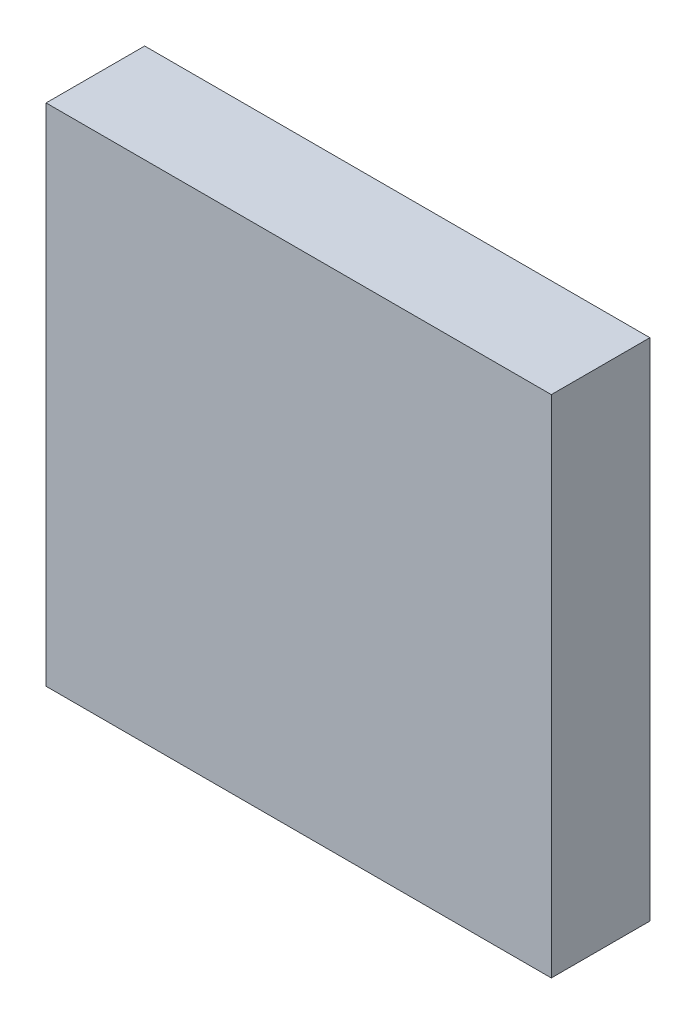
ISO-10303-21;
HEADER;
FILE_DESCRIPTION(('STEP AP214'),'2;1');
FILE_NAME('part.step','',(''),(''),'','','');
FILE_SCHEMA(('AUTOMOTIVE_DESIGN { 1 0 10303 214 1 1 1 1 }'));
ENDSEC;
DATA;
#1=APPLICATION_CONTEXT('core data for automotive mechanical design processes');
#2=APPLICATION_PROTOCOL_DEFINITION('international standard','automotive_design',2000,#1);
#3=PRODUCT_CONTEXT('',#1,'mechanical');
#4=PRODUCT('Part','Part','',(#3));
#5=PRODUCT_RELATED_PRODUCT_CATEGORY('part','',(#4));
#6=PRODUCT_DEFINITION_FORMATION('','',#4);
#7=PRODUCT_DEFINITION_CONTEXT('part definition',#1,'design');
#8=PRODUCT_DEFINITION('design','',#6,#7);
#9=PRODUCT_DEFINITION_SHAPE('','',#8);
#10=(LENGTH_UNIT() NAMED_UNIT(*) SI_UNIT(.MILLI.,.METRE.));
#11=(NAMED_UNIT(*) PLANE_ANGLE_UNIT() SI_UNIT($,.RADIAN.));
#12=(NAMED_UNIT(*) SI_UNIT($,.STERADIAN.) SOLID_ANGLE_UNIT());
#13=UNCERTAINTY_MEASURE_WITH_UNIT(LENGTH_MEASURE(1.E-05),#10,'distance_accuracy_value','');
#14=(GEOMETRIC_REPRESENTATION_CONTEXT(3) GLOBAL_UNCERTAINTY_ASSIGNED_CONTEXT((#13)) GLOBAL_UNIT_ASSIGNED_CONTEXT((#10,
#11,#12)) REPRESENTATION_CONTEXT('',''));
#15=CARTESIAN_POINT('',(0.,0.,0.));
#16=DIRECTION('',(0.,0.,1.));
#17=DIRECTION('',(1.,0.,0.));
#18=AXIS2_PLACEMENT_3D('',#15,#16,#17);
#19=CARTESIAN_POINT('',(2.04999844,-2.04999844,0.80000094));
#20=DIRECTION('',(0.,0.,-1.));
#21=DIRECTION('',(-1.,0.,0.));
#22=AXIS2_PLACEMENT_3D('',#19,#20,#21);
#23=PLANE('',#22);
#24=DIRECTION('',(0.999999999999808,6.19512282027681E-07,0.));
#25=VECTOR('',#24,1.);
#26=CARTESIAN_POINT('',(2.05000098,2.05000352,0.80000094));
#27=LINE('',#26,#25);
#28=CARTESIAN_POINT('',(2.05000098,2.05000225,0.80000094));
#29=VERTEX_POINT('',#28);
#30=CARTESIAN_POINT('',(-2.04999971,2.05000098,0.80000094));
#31=VERTEX_POINT('',#30);
#32=EDGE_CURVE('E55',#29,#31,#27,.F.);
#33=ORIENTED_EDGE('',*,*,#32,.T.);
#34=DIRECTION('',(6.19511899965481E-07,0.999999999999808,0.));
#35=VECTOR('',#34,1.);
#36=CARTESIAN_POINT('',(-2.04999844,2.05000098,0.80000094));
#37=LINE('',#36,#35);
#38=CARTESIAN_POINT('',(-2.05000098,-2.04999971,0.80000094));
#39=VERTEX_POINT('',#38);
#40=EDGE_CURVE('E57',#31,#39,#37,.F.);
#41=ORIENTED_EDGE('',*,*,#40,.T.);
#42=DIRECTION('',(-0.999999999999808,-6.19512282027681E-07,0.));
#43=VECTOR('',#42,1.);
#44=CARTESIAN_POINT('',(-2.05000098,-2.05000098,0.80000094));
#45=LINE('',#44,#43);
#46=CARTESIAN_POINT('',(2.049999075,-2.04999844,0.80000094));
#47=VERTEX_POINT('',#46);
#48=EDGE_CURVE('E20',#39,#47,#45,.F.);
#49=ORIENTED_EDGE('',*,*,#48,.T.);
#50=DIRECTION('',(-6.19511898232481E-07,-0.999999999999808,0.));
#51=VECTOR('',#50,1.);
#52=CARTESIAN_POINT('',(2.04999844,-2.04999844,0.80000094));
#53=LINE('',#52,#51);
#54=EDGE_CURVE('E80',#47,#29,#53,.F.);
#55=ORIENTED_EDGE('',*,*,#54,.T.);
#56=EDGE_LOOP('',(#33,#41,#49,#55));
#57=FACE_BOUND('',#56,.T.);
#58=ADVANCED_FACE('F17',(#57),#23,.F.);
#59=CARTESIAN_POINT('',(-2.05000098,-2.05000098,0.));
#60=DIRECTION('',(-6.19512282027681E-07,0.999999999999808,0.));
#61=DIRECTION('',(-0.999999999999808,-6.19512282027681E-07,0.));
#62=AXIS2_PLACEMENT_3D('',#59,#60,#61);
#63=PLANE('',#62);
#64=DIRECTION('',(0.,0.,1.));
#65=VECTOR('',#64,1.);
#66=CARTESIAN_POINT('',(2.04999844,-2.04999844,0.));
#67=LINE('',#66,#65);
#68=CARTESIAN_POINT('',(2.049999075,-2.04999844,0.));
#69=VERTEX_POINT('',#68);
#70=EDGE_CURVE('E68',#69,#47,#67,.T.);
#71=ORIENTED_EDGE('',*,*,#70,.T.);
#72=ORIENTED_EDGE('',*,*,#48,.F.);
#73=DIRECTION('',(0.,0.,1.));
#74=VECTOR('',#73,1.);
#75=CARTESIAN_POINT('',(-2.05000098,-2.05000098,0.));
#76=LINE('',#75,#74);
#77=CARTESIAN_POINT('',(-2.05000098,-2.050000345,0.));
#78=VERTEX_POINT('',#77);
#79=EDGE_CURVE('E63',#39,#78,#76,.F.);
#80=ORIENTED_EDGE('',*,*,#79,.T.);
#81=DIRECTION('',(-1.,0.,0.));
#82=VECTOR('',#81,1.);
#83=CARTESIAN_POINT('',(2.04999844,-2.04999844,0.));
#84=LINE('',#83,#82);
#85=EDGE_CURVE('E83',#69,#78,#84,.T.);
#86=ORIENTED_EDGE('',*,*,#85,.F.);
#87=EDGE_LOOP('',(#71,#72,#80,#86));
#88=FACE_BOUND('',#87,.T.);
#89=ADVANCED_FACE('F65',(#88),#63,.F.);
#90=CARTESIAN_POINT('',(-2.04999844,2.05000098,0.));
#91=DIRECTION('',(0.999999999999808,-6.19511899965481E-07,0.));
#92=DIRECTION('',(6.19511899965481E-07,0.999999999999808,0.));
#93=AXIS2_PLACEMENT_3D('',#90,#91,#92);
#94=PLANE('',#93);
#95=ORIENTED_EDGE('',*,*,#79,.F.);
#96=ORIENTED_EDGE('',*,*,#40,.F.);
#97=DIRECTION('',(0.,0.,1.));
#98=VECTOR('',#97,1.);
#99=CARTESIAN_POINT('',(-2.04999844,2.05000098,0.));
#100=LINE('',#99,#98);
#101=CARTESIAN_POINT('',(-2.049999075,2.05000098,0.));
#102=VERTEX_POINT('',#101);
#103=EDGE_CURVE('E75',#31,#102,#100,.F.);
#104=ORIENTED_EDGE('',*,*,#103,.T.);
#105=DIRECTION('',(0.,1.,0.));
#106=VECTOR('',#105,1.);
#107=CARTESIAN_POINT('',(-2.05000098,-2.04999844,0.));
#108=LINE('',#107,#106);
#109=EDGE_CURVE('E72',#78,#102,#108,.T.);
#110=ORIENTED_EDGE('',*,*,#109,.F.);
#111=EDGE_LOOP('',(#95,#96,#104,#110));
#112=FACE_BOUND('',#111,.T.);
#113=ADVANCED_FACE('F70',(#112),#94,.F.);
#114=CARTESIAN_POINT('',(2.05000098,2.05000352,0.));
#115=DIRECTION('',(6.19512282027681E-07,-0.999999999999808,0.));
#116=DIRECTION('',(0.999999999999808,6.19512282027681E-07,0.));
#117=AXIS2_PLACEMENT_3D('',#114,#115,#116);
#118=PLANE('',#117);
#119=ORIENTED_EDGE('',*,*,#103,.F.);
#120=ORIENTED_EDGE('',*,*,#32,.F.);
#121=DIRECTION('',(0.,0.,1.));
#122=VECTOR('',#121,1.);
#123=CARTESIAN_POINT('',(2.05000098,2.05000352,0.));
#124=LINE('',#123,#122);
#125=CARTESIAN_POINT('',(2.05000098,2.050002885,0.));
#126=VERTEX_POINT('',#125);
#127=EDGE_CURVE('E35',#29,#126,#124,.F.);
#128=ORIENTED_EDGE('',*,*,#127,.T.);
#129=DIRECTION('',(-1.,0.,0.));
#130=VECTOR('',#129,1.);
#131=CARTESIAN_POINT('',(2.04999844,2.05000098,0.));
#132=LINE('',#131,#130);
#133=EDGE_CURVE('E26',#102,#126,#132,.F.);
#134=ORIENTED_EDGE('',*,*,#133,.F.);
#135=EDGE_LOOP('',(#119,#120,#128,#134));
#136=FACE_BOUND('',#135,.T.);
#137=ADVANCED_FACE('F89',(#136),#118,.F.);
#138=CARTESIAN_POINT('',(2.04999844,-2.04999844,0.));
#139=DIRECTION('',(-0.999999999999808,6.19511898232481E-07,0.));
#140=DIRECTION('',(-6.19511898232481E-07,-0.999999999999808,0.));
#141=AXIS2_PLACEMENT_3D('',#138,#139,#140);
#142=PLANE('',#141);
#143=ORIENTED_EDGE('',*,*,#127,.F.);
#144=ORIENTED_EDGE('',*,*,#54,.F.);
#145=ORIENTED_EDGE('',*,*,#70,.F.);
#146=DIRECTION('',(0.,1.,0.));
#147=VECTOR('',#146,1.);
#148=CARTESIAN_POINT('',(2.05000098,-2.04999844,0.));
#149=LINE('',#148,#147);
#150=EDGE_CURVE('E11',#126,#69,#149,.F.);
#151=ORIENTED_EDGE('',*,*,#150,.F.);
#152=EDGE_LOOP('',(#143,#144,#145,#151));
#153=FACE_BOUND('',#152,.T.);
#154=ADVANCED_FACE('F91',(#153),#142,.F.);
#155=CARTESIAN_POINT('',(2.04999844,-2.04999844,0.));
#156=DIRECTION('',(0.,0.,-1.));
#157=DIRECTION('',(-1.,0.,0.));
#158=AXIS2_PLACEMENT_3D('',#155,#156,#157);
#159=PLANE('',#158);
#160=ORIENTED_EDGE('',*,*,#133,.T.);
#161=ORIENTED_EDGE('',*,*,#150,.T.);
#162=ORIENTED_EDGE('',*,*,#85,.T.);
#163=ORIENTED_EDGE('',*,*,#109,.T.);
#164=EDGE_LOOP('',(#160,#161,#162,#163));
#165=FACE_BOUND('',#164,.T.);
#166=ADVANCED_FACE('F88',(#165),#159,.T.);
#167=CLOSED_SHELL('',(#58,#89,#113,#137,#154,#166));
#168=MANIFOLD_SOLID_BREP('B1',#167);
#169=ADVANCED_BREP_SHAPE_REPRESENTATION('',(#18,#168),#14);
#170=SHAPE_DEFINITION_REPRESENTATION(#9,#169);
ENDSEC;
END-ISO-10303-21;
